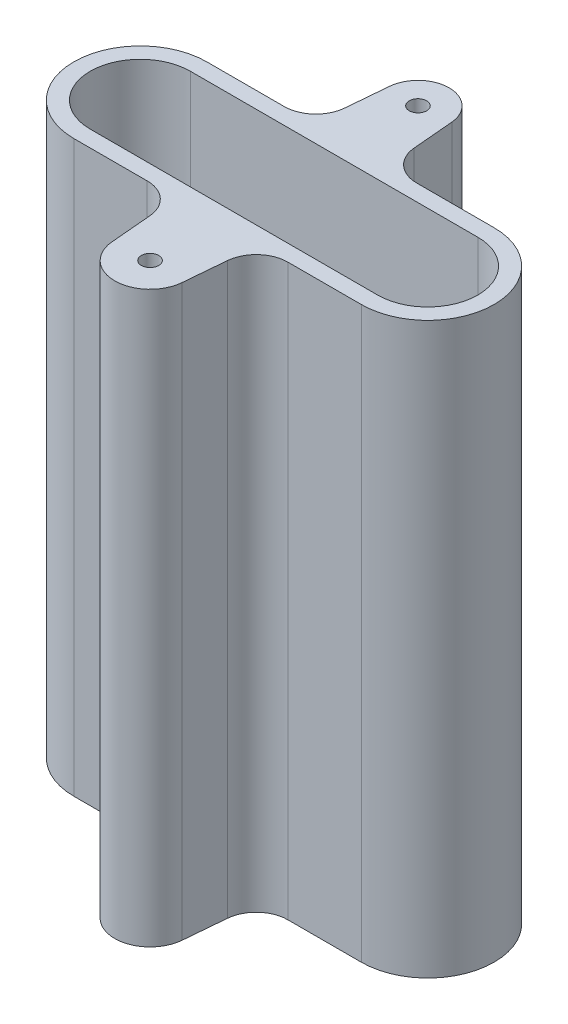
ISO-10303-21;
HEADER;
FILE_DESCRIPTION(('STEP AP214'),'2;1');
FILE_NAME('part.step','',(''),(''),'','','');
FILE_SCHEMA(('AUTOMOTIVE_DESIGN { 1 0 10303 214 1 1 1 1 }'));
ENDSEC;
DATA;
#1=APPLICATION_CONTEXT('core data for automotive mechanical design processes');
#2=APPLICATION_PROTOCOL_DEFINITION('international standard','automotive_design',2000,#1);
#3=PRODUCT_CONTEXT('',#1,'mechanical');
#4=PRODUCT('Part','Part','',(#3));
#5=PRODUCT_RELATED_PRODUCT_CATEGORY('part','',(#4));
#6=PRODUCT_DEFINITION_FORMATION('','',#4);
#7=PRODUCT_DEFINITION_CONTEXT('part definition',#1,'design');
#8=PRODUCT_DEFINITION('design','',#6,#7);
#9=PRODUCT_DEFINITION_SHAPE('','',#8);
#10=(LENGTH_UNIT() NAMED_UNIT(*) SI_UNIT(.MILLI.,.METRE.));
#11=(NAMED_UNIT(*) PLANE_ANGLE_UNIT() SI_UNIT($,.RADIAN.));
#12=(NAMED_UNIT(*) SI_UNIT($,.STERADIAN.) SOLID_ANGLE_UNIT());
#13=UNCERTAINTY_MEASURE_WITH_UNIT(LENGTH_MEASURE(1.E-05),#10,'distance_accuracy_value','');
#14=(GEOMETRIC_REPRESENTATION_CONTEXT(3) GLOBAL_UNCERTAINTY_ASSIGNED_CONTEXT((#13)) GLOBAL_UNIT_ASSIGNED_CONTEXT((#10,
#11,#12)) REPRESENTATION_CONTEXT('',''));
#15=CARTESIAN_POINT('',(0.,0.,0.));
#16=DIRECTION('',(0.,0.,1.));
#17=DIRECTION('',(1.,0.,0.));
#18=AXIS2_PLACEMENT_3D('',#15,#16,#17);
#19=CARTESIAN_POINT('',(-6.2768790723423,54.,-9.3));
#20=DIRECTION('',(0.,1.,0.));
#21=DIRECTION('',(0.,0.,1.));
#22=AXIS2_PLACEMENT_3D('',#19,#20,#21);
#23=PLANE('',#22);
#24=CARTESIAN_POINT('',(0.,54.,-12.7));
#25=DIRECTION('',(0.,1.,0.));
#26=DIRECTION('',(0.,0.,1.));
#27=AXIS2_PLACEMENT_3D('',#24,#25,#26);
#28=CIRCLE('',#27,0.825);
#29=CARTESIAN_POINT('',(0.,54.,-11.875));
#30=VERTEX_POINT('',#29);
#31=EDGE_CURVE('E198',#30,#30,#28,.T.);
#32=ORIENTED_EDGE('',*,*,#31,.F.);
#33=EDGE_LOOP('',(#32));
#34=FACE_BOUND('',#33,.T.);
#35=CARTESIAN_POINT('',(-6.2768790723423,54.,-9.3));
#36=DIRECTION('',(0.,-1.,0.));
#37=DIRECTION('',(0.,0.,1.));
#38=AXIS2_PLACEMENT_3D('',#35,#36,#37);
#39=CIRCLE('',#38,3.);
#40=CARTESIAN_POINT('',(-3.28829497806706,54.,-9.03853277175705));
#41=VERTEX_POINT('',#40);
#42=CARTESIAN_POINT('',(-6.2768790723423,54.,-6.3));
#43=VERTEX_POINT('',#42);
#44=EDGE_CURVE('E208',#41,#43,#39,.T.);
#45=ORIENTED_EDGE('',*,*,#44,.T.);
#46=DIRECTION('',(-1.,0.,0.));
#47=VECTOR('',#46,1.);
#48=CARTESIAN_POINT('',(-13.625,54.,-6.3));
#49=LINE('',#48,#47);
#50=CARTESIAN_POINT('',(-13.625,54.,-6.3));
#51=VERTEX_POINT('',#50);
#52=EDGE_CURVE('E211',#43,#51,#49,.T.);
#53=ORIENTED_EDGE('',*,*,#52,.T.);
#54=CARTESIAN_POINT('',(-13.625,54.,0.));
#55=DIRECTION('',(0.,1.,0.));
#56=DIRECTION('',(0.,0.,1.));
#57=AXIS2_PLACEMENT_3D('',#54,#55,#56);
#58=CIRCLE('',#57,6.3);
#59=CARTESIAN_POINT('',(-13.625,54.,6.3));
#60=VERTEX_POINT('',#59);
#61=EDGE_CURVE('E214',#51,#60,#58,.T.);
#62=ORIENTED_EDGE('',*,*,#61,.T.);
#63=DIRECTION('',(1.,0.,0.));
#64=VECTOR('',#63,1.);
#65=CARTESIAN_POINT('',(-6.66675096804103,54.,6.3));
#66=LINE('',#65,#64);
#67=CARTESIAN_POINT('',(-6.66675096804103,54.,6.3));
#68=VERTEX_POINT('',#67);
#69=EDGE_CURVE('E216',#60,#68,#66,.T.);
#70=ORIENTED_EDGE('',*,*,#69,.T.);
#71=CARTESIAN_POINT('',(-6.66675096804103,54.,9.3));
#72=DIRECTION('',(0.,-1.,0.));
#73=DIRECTION('',(0.,0.,1.));
#74=AXIS2_PLACEMENT_3D('',#71,#72,#73);
#75=CIRCLE('',#74,3.);
#76=CARTESIAN_POINT('',(-3.6781668737658,54.,9.03853277175703));
#77=VERTEX_POINT('',#76);
#78=EDGE_CURVE('E218',#68,#77,#75,.T.);
#79=ORIENTED_EDGE('',*,*,#78,.T.);
#80=DIRECTION('',(0.0871557427476582,0.,0.996194698091746));
#81=VECTOR('',#80,1.);
#82=CARTESIAN_POINT('',(-3.33232350807573,54.,12.9915405301576));
#83=LINE('',#82,#81);
#84=CARTESIAN_POINT('',(-3.33232350807573,54.,12.9915405301576));
#85=VERTEX_POINT('',#84);
#86=EDGE_CURVE('E220',#77,#85,#83,.T.);
#87=ORIENTED_EDGE('',*,*,#86,.T.);
#88=CARTESIAN_POINT('',(0.,54.,12.7));
#89=DIRECTION('',(0.,1.,0.));
#90=DIRECTION('',(0.,0.,1.));
#91=AXIS2_PLACEMENT_3D('',#88,#89,#90);
#92=CIRCLE('',#91,3.34505244251845);
#93=CARTESIAN_POINT('',(3.33232350807573,54.,12.9915405301576));
#94=VERTEX_POINT('',#93);
#95=EDGE_CURVE('E222',#85,#94,#92,.T.);
#96=ORIENTED_EDGE('',*,*,#95,.T.);
#97=DIRECTION('',(0.0871557427476583,0.,-0.996194698091746));
#98=VECTOR('',#97,1.);
#99=CARTESIAN_POINT('',(3.33232350807573,54.,12.9915405301576));
#100=LINE('',#99,#98);
#101=CARTESIAN_POINT('',(3.6781668737658,54.,9.03853277175702));
#102=VERTEX_POINT('',#101);
#103=EDGE_CURVE('E224',#94,#102,#100,.T.);
#104=ORIENTED_EDGE('',*,*,#103,.T.);
#105=CARTESIAN_POINT('',(6.66675096804103,54.,9.3));
#106=DIRECTION('',(0.,-1.,0.));
#107=DIRECTION('',(0.,0.,-1.));
#108=AXIS2_PLACEMENT_3D('',#105,#106,#107);
#109=CIRCLE('',#108,3.);
#110=CARTESIAN_POINT('',(6.66675096804103,54.,6.3));
#111=VERTEX_POINT('',#110);
#112=EDGE_CURVE('E226',#102,#111,#109,.T.);
#113=ORIENTED_EDGE('',*,*,#112,.T.);
#114=DIRECTION('',(1.,0.,0.));
#115=VECTOR('',#114,1.);
#116=CARTESIAN_POINT('',(13.625,54.,6.3));
#117=LINE('',#116,#115);
#118=CARTESIAN_POINT('',(13.625,54.,6.3));
#119=VERTEX_POINT('',#118);
#120=EDGE_CURVE('E228',#111,#119,#117,.T.);
#121=ORIENTED_EDGE('',*,*,#120,.T.);
#122=CARTESIAN_POINT('',(13.625,54.,0.));
#123=DIRECTION('',(0.,1.,0.));
#124=DIRECTION('',(0.,0.,-1.));
#125=AXIS2_PLACEMENT_3D('',#122,#123,#124);
#126=CIRCLE('',#125,6.3);
#127=CARTESIAN_POINT('',(13.625,54.,-6.3));
#128=VERTEX_POINT('',#127);
#129=EDGE_CURVE('E230',#119,#128,#126,.T.);
#130=ORIENTED_EDGE('',*,*,#129,.T.);
#131=DIRECTION('',(-1.,0.,0.));
#132=VECTOR('',#131,1.);
#133=CARTESIAN_POINT('',(6.2768790723423,54.,-6.3));
#134=LINE('',#133,#132);
#135=CARTESIAN_POINT('',(6.2768790723423,54.,-6.3));
#136=VERTEX_POINT('',#135);
#137=EDGE_CURVE('E232',#128,#136,#134,.T.);
#138=ORIENTED_EDGE('',*,*,#137,.T.);
#139=CARTESIAN_POINT('',(6.2768790723423,54.,-9.3));
#140=DIRECTION('',(0.,-1.,0.));
#141=DIRECTION('',(0.,0.,-1.));
#142=AXIS2_PLACEMENT_3D('',#139,#140,#141);
#143=CIRCLE('',#142,3.);
#144=CARTESIAN_POINT('',(3.28829497806706,54.,-9.03853277175705));
#145=VERTEX_POINT('',#144);
#146=EDGE_CURVE('E234',#136,#145,#143,.T.);
#147=ORIENTED_EDGE('',*,*,#146,.T.);
#148=DIRECTION('',(-0.0871557427476509,0.,-0.996194698091746));
#149=VECTOR('',#148,1.);
#150=CARTESIAN_POINT('',(2.94541312744355,54.,-12.9576902580517));
#151=LINE('',#150,#149);
#152=CARTESIAN_POINT('',(2.94541312744355,54.,-12.9576902580517));
#153=VERTEX_POINT('',#152);
#154=EDGE_CURVE('E236',#145,#153,#151,.T.);
#155=ORIENTED_EDGE('',*,*,#154,.T.);
#156=CARTESIAN_POINT('',(0.,54.,-12.7));
#157=DIRECTION('',(0.,1.,0.));
#158=DIRECTION('',(0.,0.,1.));
#159=AXIS2_PLACEMENT_3D('',#156,#157,#158);
#160=CIRCLE('',#159,2.95666412708842);
#161=CARTESIAN_POINT('',(-2.94541312744354,54.,-12.9576902580517));
#162=VERTEX_POINT('',#161);
#163=EDGE_CURVE('E238',#153,#162,#160,.T.);
#164=ORIENTED_EDGE('',*,*,#163,.T.);
#165=DIRECTION('',(-0.0871557427476518,0.,0.996194698091746));
#166=VECTOR('',#165,1.);
#167=CARTESIAN_POINT('',(-2.94541312744354,54.,-12.9576902580517));
#168=LINE('',#167,#166);
#169=EDGE_CURVE('E240',#162,#41,#168,.T.);
#170=ORIENTED_EDGE('',*,*,#169,.T.);
#171=EDGE_LOOP('',(#45,#53,#62,#70,#79,#87,#96,#104,#113,#121,#130,#138,#147,#155,#164,#170));
#172=FACE_BOUND('',#171,.T.);
#173=DIRECTION('',(1.,0.,0.));
#174=VECTOR('',#173,1.);
#175=CARTESIAN_POINT('',(-13.625,54.,4.75));
#176=LINE('',#175,#174);
#177=CARTESIAN_POINT('',(-13.625,54.,4.75));
#178=VERTEX_POINT('',#177);
#179=CARTESIAN_POINT('',(13.625,54.,4.75));
#180=VERTEX_POINT('',#179);
#181=EDGE_CURVE('E177',#178,#180,#176,.T.);
#182=ORIENTED_EDGE('',*,*,#181,.F.);
#183=CARTESIAN_POINT('',(-13.625,54.,0.));
#184=DIRECTION('',(0.,1.,0.));
#185=DIRECTION('',(0.,0.,1.));
#186=AXIS2_PLACEMENT_3D('',#183,#184,#185);
#187=CIRCLE('',#186,4.75);
#188=CARTESIAN_POINT('',(-13.625,54.,-4.75));
#189=VERTEX_POINT('',#188);
#190=EDGE_CURVE('E169',#189,#178,#187,.T.);
#191=ORIENTED_EDGE('',*,*,#190,.F.);
#192=DIRECTION('',(-1.,0.,0.));
#193=VECTOR('',#192,1.);
#194=CARTESIAN_POINT('',(-13.625,54.,-4.75));
#195=LINE('',#194,#193);
#196=CARTESIAN_POINT('',(13.625,54.,-4.75));
#197=VERTEX_POINT('',#196);
#198=EDGE_CURVE('E192',#197,#189,#195,.T.);
#199=ORIENTED_EDGE('',*,*,#198,.F.);
#200=CARTESIAN_POINT('',(13.625,54.,0.));
#201=DIRECTION('',(0.,1.,0.));
#202=DIRECTION('',(0.,0.,1.));
#203=AXIS2_PLACEMENT_3D('',#200,#201,#202);
#204=CIRCLE('',#203,4.75);
#205=EDGE_CURVE('E190',#180,#197,#204,.T.);
#206=ORIENTED_EDGE('',*,*,#205,.F.);
#207=EDGE_LOOP('',(#182,#191,#199,#206));
#208=FACE_BOUND('',#207,.T.);
#209=CARTESIAN_POINT('',(0.,54.,12.7));
#210=DIRECTION('',(0.,1.,0.));
#211=DIRECTION('',(0.,0.,1.));
#212=AXIS2_PLACEMENT_3D('',#209,#210,#211);
#213=CIRCLE('',#212,0.825);
#214=CARTESIAN_POINT('',(0.,54.,13.525));
#215=VERTEX_POINT('',#214);
#216=EDGE_CURVE('E599',#215,#215,#213,.T.);
#217=ORIENTED_EDGE('',*,*,#216,.F.);
#218=EDGE_LOOP('',(#217));
#219=FACE_BOUND('',#218,.T.);
#220=ADVANCED_FACE('F32',(#34,#172,#208,#219),#23,.T.);
#221=CARTESIAN_POINT('',(-6.2768790723423,0.,-9.3));
#222=DIRECTION('',(0.,1.,0.));
#223=DIRECTION('',(0.,0.,1.));
#224=AXIS2_PLACEMENT_3D('',#221,#222,#223);
#225=PLANE('',#224);
#226=CARTESIAN_POINT('',(0.,0.,-12.7));
#227=DIRECTION('',(0.,1.,0.));
#228=DIRECTION('',(0.,0.,1.));
#229=AXIS2_PLACEMENT_3D('',#226,#227,#228);
#230=CIRCLE('',#229,0.825);
#231=CARTESIAN_POINT('',(0.,0.,-11.875));
#232=VERTEX_POINT('',#231);
#233=EDGE_CURVE('E605',#232,#232,#230,.T.);
#234=ORIENTED_EDGE('',*,*,#233,.T.);
#235=EDGE_LOOP('',(#234));
#236=FACE_BOUND('',#235,.T.);
#237=CARTESIAN_POINT('',(-6.2768790723423,0.,-9.3));
#238=DIRECTION('',(0.,-1.,0.));
#239=DIRECTION('',(0.,0.,1.));
#240=AXIS2_PLACEMENT_3D('',#237,#238,#239);
#241=CIRCLE('',#240,3.);
#242=CARTESIAN_POINT('',(-3.28829497806706,0.,-9.03853277175705));
#243=VERTEX_POINT('',#242);
#244=CARTESIAN_POINT('',(-6.2768790723423,0.,-6.3));
#245=VERTEX_POINT('',#244);
#246=EDGE_CURVE('E185',#243,#245,#241,.T.);
#247=ORIENTED_EDGE('',*,*,#246,.F.);
#248=DIRECTION('',(-0.0871557427476518,0.,0.996194698091746));
#249=VECTOR('',#248,1.);
#250=CARTESIAN_POINT('',(-2.94541312744354,0.,-12.9576902580517));
#251=LINE('',#250,#249);
#252=CARTESIAN_POINT('',(-2.94541312744354,0.,-12.9576902580517));
#253=VERTEX_POINT('',#252);
#254=EDGE_CURVE('E212',#253,#243,#251,.T.);
#255=ORIENTED_EDGE('',*,*,#254,.F.);
#256=CARTESIAN_POINT('',(0.,0.,-12.7));
#257=DIRECTION('',(0.,1.,0.));
#258=DIRECTION('',(0.,0.,1.));
#259=AXIS2_PLACEMENT_3D('',#256,#257,#258);
#260=CIRCLE('',#259,2.95666412708842);
#261=CARTESIAN_POINT('',(2.94541312744355,0.,-12.9576902580517));
#262=VERTEX_POINT('',#261);
#263=EDGE_CURVE('E271',#262,#253,#260,.T.);
#264=ORIENTED_EDGE('',*,*,#263,.F.);
#265=DIRECTION('',(-0.0871557427476509,0.,-0.996194698091746));
#266=VECTOR('',#265,1.);
#267=CARTESIAN_POINT('',(2.94541312744355,0.,-12.9576902580517));
#268=LINE('',#267,#266);
#269=CARTESIAN_POINT('',(3.28829497806706,0.,-9.03853277175705));
#270=VERTEX_POINT('',#269);
#271=EDGE_CURVE('E269',#270,#262,#268,.T.);
#272=ORIENTED_EDGE('',*,*,#271,.F.);
#273=CARTESIAN_POINT('',(6.2768790723423,0.,-9.3));
#274=DIRECTION('',(0.,-1.,0.));
#275=DIRECTION('',(0.,0.,-1.));
#276=AXIS2_PLACEMENT_3D('',#273,#274,#275);
#277=CIRCLE('',#276,3.);
#278=CARTESIAN_POINT('',(6.2768790723423,0.,-6.3));
#279=VERTEX_POINT('',#278);
#280=EDGE_CURVE('E267',#279,#270,#277,.T.);
#281=ORIENTED_EDGE('',*,*,#280,.F.);
#282=DIRECTION('',(-1.,0.,0.));
#283=VECTOR('',#282,1.);
#284=CARTESIAN_POINT('',(6.2768790723423,0.,-6.3));
#285=LINE('',#284,#283);
#286=CARTESIAN_POINT('',(13.625,0.,-6.3));
#287=VERTEX_POINT('',#286);
#288=EDGE_CURVE('E265',#287,#279,#285,.T.);
#289=ORIENTED_EDGE('',*,*,#288,.F.);
#290=CARTESIAN_POINT('',(13.625,0.,0.));
#291=DIRECTION('',(0.,1.,0.));
#292=DIRECTION('',(0.,0.,-1.));
#293=AXIS2_PLACEMENT_3D('',#290,#291,#292);
#294=CIRCLE('',#293,6.3);
#295=CARTESIAN_POINT('',(13.625,0.,6.3));
#296=VERTEX_POINT('',#295);
#297=EDGE_CURVE('E263',#296,#287,#294,.T.);
#298=ORIENTED_EDGE('',*,*,#297,.F.);
#299=DIRECTION('',(1.,0.,0.));
#300=VECTOR('',#299,1.);
#301=CARTESIAN_POINT('',(13.625,0.,6.3));
#302=LINE('',#301,#300);
#303=CARTESIAN_POINT('',(6.66675096804103,0.,6.3));
#304=VERTEX_POINT('',#303);
#305=EDGE_CURVE('E261',#304,#296,#302,.T.);
#306=ORIENTED_EDGE('',*,*,#305,.F.);
#307=CARTESIAN_POINT('',(6.66675096804103,0.,9.3));
#308=DIRECTION('',(0.,-1.,0.));
#309=DIRECTION('',(0.,0.,-1.));
#310=AXIS2_PLACEMENT_3D('',#307,#308,#309);
#311=CIRCLE('',#310,3.);
#312=CARTESIAN_POINT('',(3.6781668737658,0.,9.03853277175702));
#313=VERTEX_POINT('',#312);
#314=EDGE_CURVE('E259',#313,#304,#311,.T.);
#315=ORIENTED_EDGE('',*,*,#314,.F.);
#316=DIRECTION('',(0.0871557427476583,0.,-0.996194698091746));
#317=VECTOR('',#316,1.);
#318=CARTESIAN_POINT('',(3.33232350807573,0.,12.9915405301576));
#319=LINE('',#318,#317);
#320=CARTESIAN_POINT('',(3.33232350807573,0.,12.9915405301576));
#321=VERTEX_POINT('',#320);
#322=EDGE_CURVE('E257',#321,#313,#319,.T.);
#323=ORIENTED_EDGE('',*,*,#322,.F.);
#324=CARTESIAN_POINT('',(0.,0.,12.7));
#325=DIRECTION('',(0.,1.,0.));
#326=DIRECTION('',(0.,0.,1.));
#327=AXIS2_PLACEMENT_3D('',#324,#325,#326);
#328=CIRCLE('',#327,3.34505244251845);
#329=CARTESIAN_POINT('',(-3.33232350807573,0.,12.9915405301576));
#330=VERTEX_POINT('',#329);
#331=EDGE_CURVE('E255',#330,#321,#328,.T.);
#332=ORIENTED_EDGE('',*,*,#331,.F.);
#333=DIRECTION('',(0.0871557427476582,0.,0.996194698091746));
#334=VECTOR('',#333,1.);
#335=CARTESIAN_POINT('',(-3.33232350807573,0.,12.9915405301576));
#336=LINE('',#335,#334);
#337=CARTESIAN_POINT('',(-3.6781668737658,0.,9.03853277175703));
#338=VERTEX_POINT('',#337);
#339=EDGE_CURVE('E253',#338,#330,#336,.T.);
#340=ORIENTED_EDGE('',*,*,#339,.F.);
#341=CARTESIAN_POINT('',(-6.66675096804103,0.,9.3));
#342=DIRECTION('',(0.,-1.,0.));
#343=DIRECTION('',(0.,0.,1.));
#344=AXIS2_PLACEMENT_3D('',#341,#342,#343);
#345=CIRCLE('',#344,3.);
#346=CARTESIAN_POINT('',(-6.66675096804103,0.,6.3));
#347=VERTEX_POINT('',#346);
#348=EDGE_CURVE('E251',#347,#338,#345,.T.);
#349=ORIENTED_EDGE('',*,*,#348,.F.);
#350=DIRECTION('',(1.,0.,0.));
#351=VECTOR('',#350,1.);
#352=CARTESIAN_POINT('',(-6.66675096804103,0.,6.3));
#353=LINE('',#352,#351);
#354=CARTESIAN_POINT('',(-13.625,0.,6.3));
#355=VERTEX_POINT('',#354);
#356=EDGE_CURVE('E249',#355,#347,#353,.T.);
#357=ORIENTED_EDGE('',*,*,#356,.F.);
#358=CARTESIAN_POINT('',(-13.625,0.,0.));
#359=DIRECTION('',(0.,1.,0.));
#360=DIRECTION('',(0.,0.,1.));
#361=AXIS2_PLACEMENT_3D('',#358,#359,#360);
#362=CIRCLE('',#361,6.3);
#363=CARTESIAN_POINT('',(-13.625,0.,-6.3));
#364=VERTEX_POINT('',#363);
#365=EDGE_CURVE('E247',#364,#355,#362,.T.);
#366=ORIENTED_EDGE('',*,*,#365,.F.);
#367=DIRECTION('',(-1.,0.,0.));
#368=VECTOR('',#367,1.);
#369=CARTESIAN_POINT('',(-13.625,0.,-6.3));
#370=LINE('',#369,#368);
#371=EDGE_CURVE('E245',#245,#364,#370,.T.);
#372=ORIENTED_EDGE('',*,*,#371,.F.);
#373=EDGE_LOOP('',(#247,#255,#264,#272,#281,#289,#298,#306,#315,#323,#332,#340,#349,#357,#366,#372));
#374=FACE_BOUND('',#373,.T.);
#375=CARTESIAN_POINT('',(-13.625,0.,0.));
#376=DIRECTION('',(0.,1.,0.));
#377=DIRECTION('',(0.,0.,1.));
#378=AXIS2_PLACEMENT_3D('',#375,#376,#377);
#379=CIRCLE('',#378,4.75);
#380=CARTESIAN_POINT('',(-13.625,0.,-4.75));
#381=VERTEX_POINT('',#380);
#382=CARTESIAN_POINT('',(-13.625,0.,4.75));
#383=VERTEX_POINT('',#382);
#384=EDGE_CURVE('E55',#381,#383,#379,.T.);
#385=ORIENTED_EDGE('',*,*,#384,.T.);
#386=DIRECTION('',(1.,0.,0.));
#387=VECTOR('',#386,1.);
#388=CARTESIAN_POINT('',(-13.625,0.,4.75));
#389=LINE('',#388,#387);
#390=CARTESIAN_POINT('',(13.625,0.,4.75));
#391=VERTEX_POINT('',#390);
#392=EDGE_CURVE('E184',#383,#391,#389,.T.);
#393=ORIENTED_EDGE('',*,*,#392,.T.);
#394=CARTESIAN_POINT('',(13.625,0.,0.));
#395=DIRECTION('',(0.,1.,0.));
#396=DIRECTION('',(0.,0.,1.));
#397=AXIS2_PLACEMENT_3D('',#394,#395,#396);
#398=CIRCLE('',#397,4.75);
#399=CARTESIAN_POINT('',(13.625,0.,-4.75));
#400=VERTEX_POINT('',#399);
#401=EDGE_CURVE('E200',#391,#400,#398,.T.);
#402=ORIENTED_EDGE('',*,*,#401,.T.);
#403=DIRECTION('',(-1.,0.,0.));
#404=VECTOR('',#403,1.);
#405=CARTESIAN_POINT('',(-13.625,0.,-4.75));
#406=LINE('',#405,#404);
#407=EDGE_CURVE('E178',#400,#381,#406,.T.);
#408=ORIENTED_EDGE('',*,*,#407,.T.);
#409=EDGE_LOOP('',(#385,#393,#402,#408));
#410=FACE_BOUND('',#409,.T.);
#411=CARTESIAN_POINT('',(0.,0.,12.7));
#412=DIRECTION('',(0.,1.,0.));
#413=DIRECTION('',(0.,0.,1.));
#414=AXIS2_PLACEMENT_3D('',#411,#412,#413);
#415=CIRCLE('',#414,0.825);
#416=CARTESIAN_POINT('',(0.,0.,13.525));
#417=VERTEX_POINT('',#416);
#418=EDGE_CURVE('E602',#417,#417,#415,.T.);
#419=ORIENTED_EDGE('',*,*,#418,.T.);
#420=EDGE_LOOP('',(#419));
#421=FACE_BOUND('',#420,.T.);
#422=ADVANCED_FACE('F325',(#236,#374,#410,#421),#225,.F.);
#423=CARTESIAN_POINT('',(-6.2768790723423,54.,-9.3));
#424=DIRECTION('',(0.,-1.,0.));
#425=DIRECTION('',(0.,0.,-1.));
#426=AXIS2_PLACEMENT_3D('',#423,#424,#425);
#427=CYLINDRICAL_SURFACE('',#426,3.);
#428=ORIENTED_EDGE('',*,*,#246,.T.);
#429=DIRECTION('',(0.,-1.,0.));
#430=VECTOR('',#429,1.);
#431=CARTESIAN_POINT('',(-6.2768790723423,54.,-6.3));
#432=LINE('',#431,#430);
#433=EDGE_CURVE('E11',#43,#245,#432,.T.);
#434=ORIENTED_EDGE('',*,*,#433,.F.);
#435=ORIENTED_EDGE('',*,*,#44,.F.);
#436=DIRECTION('',(0.,-1.,0.));
#437=VECTOR('',#436,1.);
#438=CARTESIAN_POINT('',(-3.28829497806706,54.,-9.03853277175705));
#439=LINE('',#438,#437);
#440=EDGE_CURVE('E242',#41,#243,#439,.T.);
#441=ORIENTED_EDGE('',*,*,#440,.T.);
#442=EDGE_LOOP('',(#428,#434,#435,#441));
#443=FACE_BOUND('',#442,.T.);
#444=ADVANCED_FACE('F34',(#443),#427,.F.);
#445=CARTESIAN_POINT('',(-13.625,54.,-6.3));
#446=DIRECTION('',(0.,0.,1.));
#447=DIRECTION('',(1.,0.,0.));
#448=AXIS2_PLACEMENT_3D('',#445,#446,#447);
#449=PLANE('',#448);
#450=ORIENTED_EDGE('',*,*,#371,.T.);
#451=DIRECTION('',(0.,-1.,0.));
#452=VECTOR('',#451,1.);
#453=CARTESIAN_POINT('',(-13.625,54.,-6.3));
#454=LINE('',#453,#452);
#455=EDGE_CURVE('E40',#51,#364,#454,.T.);
#456=ORIENTED_EDGE('',*,*,#455,.F.);
#457=ORIENTED_EDGE('',*,*,#52,.F.);
#458=ORIENTED_EDGE('',*,*,#433,.T.);
#459=EDGE_LOOP('',(#450,#456,#457,#458));
#460=FACE_BOUND('',#459,.T.);
#461=ADVANCED_FACE('F342',(#460),#449,.F.);
#462=CARTESIAN_POINT('',(-13.625,54.,0.));
#463=DIRECTION('',(0.,-1.,0.));
#464=DIRECTION('',(0.,0.,-1.));
#465=AXIS2_PLACEMENT_3D('',#462,#463,#464);
#466=CYLINDRICAL_SURFACE('',#465,6.3);
#467=ORIENTED_EDGE('',*,*,#365,.T.);
#468=DIRECTION('',(0.,-1.,0.));
#469=VECTOR('',#468,1.);
#470=CARTESIAN_POINT('',(-13.625,54.,6.3));
#471=LINE('',#470,#469);
#472=EDGE_CURVE('E312',#60,#355,#471,.T.);
#473=ORIENTED_EDGE('',*,*,#472,.F.);
#474=ORIENTED_EDGE('',*,*,#61,.F.);
#475=ORIENTED_EDGE('',*,*,#455,.T.);
#476=EDGE_LOOP('',(#467,#473,#474,#475));
#477=FACE_BOUND('',#476,.T.);
#478=ADVANCED_FACE('F319',(#477),#466,.T.);
#479=CARTESIAN_POINT('',(-6.66675096804103,54.,6.3));
#480=DIRECTION('',(0.,0.,-1.));
#481=DIRECTION('',(-1.,0.,0.));
#482=AXIS2_PLACEMENT_3D('',#479,#480,#481);
#483=PLANE('',#482);
#484=ORIENTED_EDGE('',*,*,#356,.T.);
#485=DIRECTION('',(0.,-1.,0.));
#486=VECTOR('',#485,1.);
#487=CARTESIAN_POINT('',(-6.66675096804103,54.,6.3));
#488=LINE('',#487,#486);
#489=EDGE_CURVE('E309',#68,#347,#488,.T.);
#490=ORIENTED_EDGE('',*,*,#489,.F.);
#491=ORIENTED_EDGE('',*,*,#69,.F.);
#492=ORIENTED_EDGE('',*,*,#472,.T.);
#493=EDGE_LOOP('',(#484,#490,#491,#492));
#494=FACE_BOUND('',#493,.T.);
#495=ADVANCED_FACE('F331',(#494),#483,.F.);
#496=CARTESIAN_POINT('',(-6.66675096804103,54.,9.3));
#497=DIRECTION('',(0.,-1.,0.));
#498=DIRECTION('',(0.,0.,-1.));
#499=AXIS2_PLACEMENT_3D('',#496,#497,#498);
#500=CYLINDRICAL_SURFACE('',#499,3.);
#501=ORIENTED_EDGE('',*,*,#348,.T.);
#502=DIRECTION('',(0.,-1.,0.));
#503=VECTOR('',#502,1.);
#504=CARTESIAN_POINT('',(-3.6781668737658,54.,9.03853277175703));
#505=LINE('',#504,#503);
#506=EDGE_CURVE('E306',#77,#338,#505,.T.);
#507=ORIENTED_EDGE('',*,*,#506,.F.);
#508=ORIENTED_EDGE('',*,*,#78,.F.);
#509=ORIENTED_EDGE('',*,*,#489,.T.);
#510=EDGE_LOOP('',(#501,#507,#508,#509));
#511=FACE_BOUND('',#510,.T.);
#512=ADVANCED_FACE('F335',(#511),#500,.F.);
#513=CARTESIAN_POINT('',(-3.33232350807573,54.,12.9915405301576));
#514=DIRECTION('',(0.996194698091746,0.,-0.0871557427476582));
#515=DIRECTION('',(-0.0871557427476582,0.,-0.996194698091746));
#516=AXIS2_PLACEMENT_3D('',#513,#514,#515);
#517=PLANE('',#516);
#518=ORIENTED_EDGE('',*,*,#339,.T.);
#519=DIRECTION('',(0.,-1.,0.));
#520=VECTOR('',#519,1.);
#521=CARTESIAN_POINT('',(-3.33232350807573,54.,12.9915405301576));
#522=LINE('',#521,#520);
#523=EDGE_CURVE('E303',#85,#330,#522,.T.);
#524=ORIENTED_EDGE('',*,*,#523,.F.);
#525=ORIENTED_EDGE('',*,*,#86,.F.);
#526=ORIENTED_EDGE('',*,*,#506,.T.);
#527=EDGE_LOOP('',(#518,#524,#525,#526));
#528=FACE_BOUND('',#527,.T.);
#529=ADVANCED_FACE('F395',(#528),#517,.F.);
#530=CARTESIAN_POINT('',(0.,54.,12.7));
#531=DIRECTION('',(0.,-1.,0.));
#532=DIRECTION('',(0.,0.,-1.));
#533=AXIS2_PLACEMENT_3D('',#530,#531,#532);
#534=CYLINDRICAL_SURFACE('',#533,3.34505244251845);
#535=ORIENTED_EDGE('',*,*,#331,.T.);
#536=DIRECTION('',(0.,-1.,0.));
#537=VECTOR('',#536,1.);
#538=CARTESIAN_POINT('',(3.33232350807573,54.,12.9915405301576));
#539=LINE('',#538,#537);
#540=EDGE_CURVE('E300',#94,#321,#539,.T.);
#541=ORIENTED_EDGE('',*,*,#540,.F.);
#542=ORIENTED_EDGE('',*,*,#95,.F.);
#543=ORIENTED_EDGE('',*,*,#523,.T.);
#544=EDGE_LOOP('',(#535,#541,#542,#543));
#545=FACE_BOUND('',#544,.T.);
#546=ADVANCED_FACE('F392',(#545),#534,.T.);
#547=CARTESIAN_POINT('',(3.33232350807573,54.,12.9915405301576));
#548=DIRECTION('',(-0.996194698091746,0.,-0.0871557427476583));
#549=DIRECTION('',(-0.0871557427476583,0.,0.996194698091746));
#550=AXIS2_PLACEMENT_3D('',#547,#548,#549);
#551=PLANE('',#550);
#552=ORIENTED_EDGE('',*,*,#322,.T.);
#553=DIRECTION('',(0.,-1.,0.));
#554=VECTOR('',#553,1.);
#555=CARTESIAN_POINT('',(3.6781668737658,54.,9.03853277175702));
#556=LINE('',#555,#554);
#557=EDGE_CURVE('E297',#102,#313,#556,.T.);
#558=ORIENTED_EDGE('',*,*,#557,.F.);
#559=ORIENTED_EDGE('',*,*,#103,.F.);
#560=ORIENTED_EDGE('',*,*,#540,.T.);
#561=EDGE_LOOP('',(#552,#558,#559,#560));
#562=FACE_BOUND('',#561,.T.);
#563=ADVANCED_FACE('F388',(#562),#551,.F.);
#564=CARTESIAN_POINT('',(6.66675096804103,54.,9.3));
#565=DIRECTION('',(0.,-1.,0.));
#566=DIRECTION('',(0.,0.,-1.));
#567=AXIS2_PLACEMENT_3D('',#564,#565,#566);
#568=CYLINDRICAL_SURFACE('',#567,3.);
#569=ORIENTED_EDGE('',*,*,#314,.T.);
#570=DIRECTION('',(0.,-1.,0.));
#571=VECTOR('',#570,1.);
#572=CARTESIAN_POINT('',(6.66675096804103,54.,6.3));
#573=LINE('',#572,#571);
#574=EDGE_CURVE('E294',#111,#304,#573,.T.);
#575=ORIENTED_EDGE('',*,*,#574,.F.);
#576=ORIENTED_EDGE('',*,*,#112,.F.);
#577=ORIENTED_EDGE('',*,*,#557,.T.);
#578=EDGE_LOOP('',(#569,#575,#576,#577));
#579=FACE_BOUND('',#578,.T.);
#580=ADVANCED_FACE('F384',(#579),#568,.F.);
#581=CARTESIAN_POINT('',(13.625,54.,6.3));
#582=DIRECTION('',(0.,0.,-1.));
#583=DIRECTION('',(-1.,0.,0.));
#584=AXIS2_PLACEMENT_3D('',#581,#582,#583);
#585=PLANE('',#584);
#586=ORIENTED_EDGE('',*,*,#305,.T.);
#587=DIRECTION('',(0.,-1.,0.));
#588=VECTOR('',#587,1.);
#589=CARTESIAN_POINT('',(13.625,54.,6.3));
#590=LINE('',#589,#588);
#591=EDGE_CURVE('E291',#119,#296,#590,.T.);
#592=ORIENTED_EDGE('',*,*,#591,.F.);
#593=ORIENTED_EDGE('',*,*,#120,.F.);
#594=ORIENTED_EDGE('',*,*,#574,.T.);
#595=EDGE_LOOP('',(#586,#592,#593,#594));
#596=FACE_BOUND('',#595,.T.);
#597=ADVANCED_FACE('F379',(#596),#585,.F.);
#598=CARTESIAN_POINT('',(13.625,54.,0.));
#599=DIRECTION('',(0.,-1.,0.));
#600=DIRECTION('',(0.,0.,-1.));
#601=AXIS2_PLACEMENT_3D('',#598,#599,#600);
#602=CYLINDRICAL_SURFACE('',#601,6.3);
#603=ORIENTED_EDGE('',*,*,#297,.T.);
#604=DIRECTION('',(0.,-1.,0.));
#605=VECTOR('',#604,1.);
#606=CARTESIAN_POINT('',(13.625,54.,-6.3));
#607=LINE('',#606,#605);
#608=EDGE_CURVE('E288',#128,#287,#607,.T.);
#609=ORIENTED_EDGE('',*,*,#608,.F.);
#610=ORIENTED_EDGE('',*,*,#129,.F.);
#611=ORIENTED_EDGE('',*,*,#591,.T.);
#612=EDGE_LOOP('',(#603,#609,#610,#611));
#613=FACE_BOUND('',#612,.T.);
#614=ADVANCED_FACE('F373',(#613),#602,.T.);
#615=CARTESIAN_POINT('',(6.2768790723423,54.,-6.3));
#616=DIRECTION('',(0.,0.,1.));
#617=DIRECTION('',(1.,0.,0.));
#618=AXIS2_PLACEMENT_3D('',#615,#616,#617);
#619=PLANE('',#618);
#620=ORIENTED_EDGE('',*,*,#288,.T.);
#621=DIRECTION('',(0.,-1.,0.));
#622=VECTOR('',#621,1.);
#623=CARTESIAN_POINT('',(6.2768790723423,54.,-6.3));
#624=LINE('',#623,#622);
#625=EDGE_CURVE('E285',#136,#279,#624,.T.);
#626=ORIENTED_EDGE('',*,*,#625,.F.);
#627=ORIENTED_EDGE('',*,*,#137,.F.);
#628=ORIENTED_EDGE('',*,*,#608,.T.);
#629=EDGE_LOOP('',(#620,#626,#627,#628));
#630=FACE_BOUND('',#629,.T.);
#631=ADVANCED_FACE('F369',(#630),#619,.F.);
#632=CARTESIAN_POINT('',(6.2768790723423,54.,-9.3));
#633=DIRECTION('',(0.,-1.,0.));
#634=DIRECTION('',(0.,0.,-1.));
#635=AXIS2_PLACEMENT_3D('',#632,#633,#634);
#636=CYLINDRICAL_SURFACE('',#635,3.);
#637=ORIENTED_EDGE('',*,*,#280,.T.);
#638=DIRECTION('',(0.,-1.,0.));
#639=VECTOR('',#638,1.);
#640=CARTESIAN_POINT('',(3.28829497806706,54.,-9.03853277175705));
#641=LINE('',#640,#639);
#642=EDGE_CURVE('E282',#145,#270,#641,.T.);
#643=ORIENTED_EDGE('',*,*,#642,.F.);
#644=ORIENTED_EDGE('',*,*,#146,.F.);
#645=ORIENTED_EDGE('',*,*,#625,.T.);
#646=EDGE_LOOP('',(#637,#643,#644,#645));
#647=FACE_BOUND('',#646,.T.);
#648=ADVANCED_FACE('F364',(#647),#636,.F.);
#649=CARTESIAN_POINT('',(2.94541312744355,54.,-12.9576902580517));
#650=DIRECTION('',(-0.996194698091746,0.,0.0871557427476509));
#651=DIRECTION('',(0.0871557427476509,0.,0.996194698091746));
#652=AXIS2_PLACEMENT_3D('',#649,#650,#651);
#653=PLANE('',#652);
#654=ORIENTED_EDGE('',*,*,#271,.T.);
#655=DIRECTION('',(0.,-1.,0.));
#656=VECTOR('',#655,1.);
#657=CARTESIAN_POINT('',(2.94541312744355,54.,-12.9576902580517));
#658=LINE('',#657,#656);
#659=EDGE_CURVE('E279',#153,#262,#658,.T.);
#660=ORIENTED_EDGE('',*,*,#659,.F.);
#661=ORIENTED_EDGE('',*,*,#154,.F.);
#662=ORIENTED_EDGE('',*,*,#642,.T.);
#663=EDGE_LOOP('',(#654,#660,#661,#662));
#664=FACE_BOUND('',#663,.T.);
#665=ADVANCED_FACE('F358',(#664),#653,.F.);
#666=CARTESIAN_POINT('',(0.,54.,-12.7));
#667=DIRECTION('',(0.,-1.,0.));
#668=DIRECTION('',(0.,0.,-1.));
#669=AXIS2_PLACEMENT_3D('',#666,#667,#668);
#670=CYLINDRICAL_SURFACE('',#669,2.95666412708842);
#671=ORIENTED_EDGE('',*,*,#263,.T.);
#672=DIRECTION('',(0.,-1.,0.));
#673=VECTOR('',#672,1.);
#674=CARTESIAN_POINT('',(-2.94541312744354,54.,-12.9576902580517));
#675=LINE('',#674,#673);
#676=EDGE_CURVE('E276',#162,#253,#675,.T.);
#677=ORIENTED_EDGE('',*,*,#676,.F.);
#678=ORIENTED_EDGE('',*,*,#163,.F.);
#679=ORIENTED_EDGE('',*,*,#659,.T.);
#680=EDGE_LOOP('',(#671,#677,#678,#679));
#681=FACE_BOUND('',#680,.T.);
#682=ADVANCED_FACE('F354',(#681),#670,.T.);
#683=CARTESIAN_POINT('',(-2.94541312744354,54.,-12.9576902580517));
#684=DIRECTION('',(0.996194698091746,0.,0.0871557427476519));
#685=DIRECTION('',(0.0871557427476519,0.,-0.996194698091746));
#686=AXIS2_PLACEMENT_3D('',#683,#684,#685);
#687=PLANE('',#686);
#688=ORIENTED_EDGE('',*,*,#254,.T.);
#689=ORIENTED_EDGE('',*,*,#440,.F.);
#690=ORIENTED_EDGE('',*,*,#169,.F.);
#691=ORIENTED_EDGE('',*,*,#676,.T.);
#692=EDGE_LOOP('',(#688,#689,#690,#691));
#693=FACE_BOUND('',#692,.T.);
#694=ADVANCED_FACE('F349',(#693),#687,.F.);
#695=CARTESIAN_POINT('',(-13.625,54.,0.));
#696=DIRECTION('',(0.,-1.,0.));
#697=DIRECTION('',(0.,0.,-1.));
#698=AXIS2_PLACEMENT_3D('',#695,#696,#697);
#699=CYLINDRICAL_SURFACE('',#698,4.75);
#700=ORIENTED_EDGE('',*,*,#384,.F.);
#701=DIRECTION('',(0.,-1.,0.));
#702=VECTOR('',#701,1.);
#703=CARTESIAN_POINT('',(-13.625,54.,-4.75));
#704=LINE('',#703,#702);
#705=EDGE_CURVE('E173',#189,#381,#704,.T.);
#706=ORIENTED_EDGE('',*,*,#705,.F.);
#707=ORIENTED_EDGE('',*,*,#190,.T.);
#708=DIRECTION('',(0.,-1.,0.));
#709=VECTOR('',#708,1.);
#710=CARTESIAN_POINT('',(-13.625,54.,4.75));
#711=LINE('',#710,#709);
#712=EDGE_CURVE('E172',#178,#383,#711,.T.);
#713=ORIENTED_EDGE('',*,*,#712,.T.);
#714=EDGE_LOOP('',(#700,#706,#707,#713));
#715=FACE_BOUND('',#714,.T.);
#716=ADVANCED_FACE('F171',(#715),#699,.F.);
#717=CARTESIAN_POINT('',(-13.625,54.,4.75));
#718=DIRECTION('',(0.,0.,-1.));
#719=DIRECTION('',(-1.,0.,0.));
#720=AXIS2_PLACEMENT_3D('',#717,#718,#719);
#721=PLANE('',#720);
#722=ORIENTED_EDGE('',*,*,#392,.F.);
#723=ORIENTED_EDGE('',*,*,#712,.F.);
#724=ORIENTED_EDGE('',*,*,#181,.T.);
#725=DIRECTION('',(0.,-1.,0.));
#726=VECTOR('',#725,1.);
#727=CARTESIAN_POINT('',(13.625,54.,4.75));
#728=LINE('',#727,#726);
#729=EDGE_CURVE('E186',#180,#391,#728,.T.);
#730=ORIENTED_EDGE('',*,*,#729,.T.);
#731=EDGE_LOOP('',(#722,#723,#724,#730));
#732=FACE_BOUND('',#731,.T.);
#733=ADVANCED_FACE('F181',(#732),#721,.T.);
#734=CARTESIAN_POINT('',(13.625,54.,0.));
#735=DIRECTION('',(0.,-1.,0.));
#736=DIRECTION('',(0.,0.,-1.));
#737=AXIS2_PLACEMENT_3D('',#734,#735,#736);
#738=CYLINDRICAL_SURFACE('',#737,4.75);
#739=ORIENTED_EDGE('',*,*,#401,.F.);
#740=ORIENTED_EDGE('',*,*,#729,.F.);
#741=ORIENTED_EDGE('',*,*,#205,.T.);
#742=DIRECTION('',(0.,-1.,0.));
#743=VECTOR('',#742,1.);
#744=CARTESIAN_POINT('',(13.625,54.,-4.75));
#745=LINE('',#744,#743);
#746=EDGE_CURVE('E47',#197,#400,#745,.T.);
#747=ORIENTED_EDGE('',*,*,#746,.T.);
#748=EDGE_LOOP('',(#739,#740,#741,#747));
#749=FACE_BOUND('',#748,.T.);
#750=ADVANCED_FACE('F480',(#749),#738,.F.);
#751=CARTESIAN_POINT('',(-13.625,54.,-4.75));
#752=DIRECTION('',(0.,0.,1.));
#753=DIRECTION('',(1.,0.,0.));
#754=AXIS2_PLACEMENT_3D('',#751,#752,#753);
#755=PLANE('',#754);
#756=ORIENTED_EDGE('',*,*,#407,.F.);
#757=ORIENTED_EDGE('',*,*,#746,.F.);
#758=ORIENTED_EDGE('',*,*,#198,.T.);
#759=ORIENTED_EDGE('',*,*,#705,.T.);
#760=EDGE_LOOP('',(#756,#757,#758,#759));
#761=FACE_BOUND('',#760,.T.);
#762=ADVANCED_FACE('F486',(#761),#755,.T.);
#763=CARTESIAN_POINT('',(0.,54.,-12.7));
#764=DIRECTION('',(0.,-1.,0.));
#765=DIRECTION('',(0.,0.,-1.));
#766=AXIS2_PLACEMENT_3D('',#763,#764,#765);
#767=CYLINDRICAL_SURFACE('',#766,0.825);
#768=ORIENTED_EDGE('',*,*,#31,.T.);
#769=EDGE_LOOP('',(#768));
#770=FACE_BOUND('',#769,.T.);
#771=ORIENTED_EDGE('',*,*,#233,.F.);
#772=EDGE_LOOP('',(#771));
#773=FACE_BOUND('',#772,.T.);
#774=ADVANCED_FACE('F494',(#770,#773),#767,.F.);
#775=CARTESIAN_POINT('',(0.,54.,12.7));
#776=DIRECTION('',(0.,-1.,0.));
#777=DIRECTION('',(0.,0.,-1.));
#778=AXIS2_PLACEMENT_3D('',#775,#776,#777);
#779=CYLINDRICAL_SURFACE('',#778,0.825);
#780=ORIENTED_EDGE('',*,*,#216,.T.);
#781=EDGE_LOOP('',(#780));
#782=FACE_BOUND('',#781,.T.);
#783=ORIENTED_EDGE('',*,*,#418,.F.);
#784=EDGE_LOOP('',(#783));
#785=FACE_BOUND('',#784,.T.);
#786=ADVANCED_FACE('F501',(#782,#785),#779,.F.);
#787=CLOSED_SHELL('',(#220,#422,#444,#461,#478,#495,#512,#529,#546,#563,#580,#597,#614,#631,
#648,#665,#682,#694,#716,#733,#750,#762,#774,#786));
#788=MANIFOLD_SOLID_BREP('B2',#787);
#789=ADVANCED_BREP_SHAPE_REPRESENTATION('',(#18,#788),#14);
#790=SHAPE_DEFINITION_REPRESENTATION(#9,#789);
ENDSEC;
END-ISO-10303-21;
